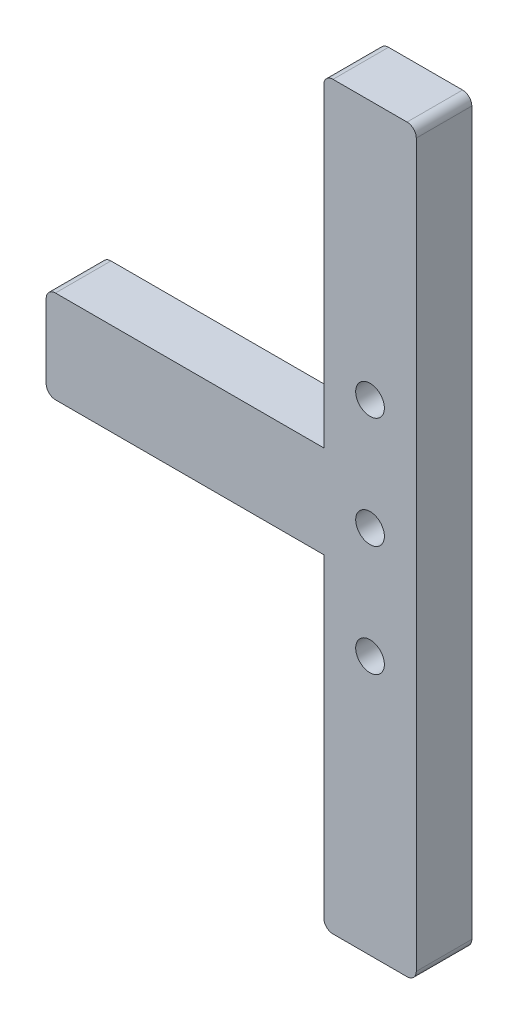
ISO-10303-21;
HEADER;
FILE_DESCRIPTION(('STEP AP214'),'2;1');
FILE_NAME('part.step','',(''),(''),'','','');
FILE_SCHEMA(('AUTOMOTIVE_DESIGN { 1 0 10303 214 1 1 1 1 }'));
ENDSEC;
DATA;
#1=APPLICATION_CONTEXT('core data for automotive mechanical design processes');
#2=APPLICATION_PROTOCOL_DEFINITION('international standard','automotive_design',2000,#1);
#3=PRODUCT_CONTEXT('',#1,'mechanical');
#4=PRODUCT('Part','Part','',(#3));
#5=PRODUCT_RELATED_PRODUCT_CATEGORY('part','',(#4));
#6=PRODUCT_DEFINITION_FORMATION('','',#4);
#7=PRODUCT_DEFINITION_CONTEXT('part definition',#1,'design');
#8=PRODUCT_DEFINITION('design','',#6,#7);
#9=PRODUCT_DEFINITION_SHAPE('','',#8);
#10=(LENGTH_UNIT() NAMED_UNIT(*) SI_UNIT(.MILLI.,.METRE.));
#11=(NAMED_UNIT(*) PLANE_ANGLE_UNIT() SI_UNIT($,.RADIAN.));
#12=(NAMED_UNIT(*) SI_UNIT($,.STERADIAN.) SOLID_ANGLE_UNIT());
#13=UNCERTAINTY_MEASURE_WITH_UNIT(LENGTH_MEASURE(1.E-05),#10,'distance_accuracy_value','');
#14=(GEOMETRIC_REPRESENTATION_CONTEXT(3) GLOBAL_UNCERTAINTY_ASSIGNED_CONTEXT((#13)) GLOBAL_UNIT_ASSIGNED_CONTEXT((#10,
#11,#12)) REPRESENTATION_CONTEXT('',''));
#15=CARTESIAN_POINT('',(0.,0.,0.));
#16=DIRECTION('',(0.,0.,1.));
#17=DIRECTION('',(1.,0.,0.));
#18=AXIS2_PLACEMENT_3D('',#15,#16,#17);
#19=CARTESIAN_POINT('',(0.,4.99999999999999,6.));
#20=DIRECTION('',(0.,-1.,0.));
#21=DIRECTION('',(1.,0.,0.));
#22=AXIS2_PLACEMENT_3D('',#19,#20,#21);
#23=PLANE('',#22);
#24=DIRECTION('',(-1.,0.,0.));
#25=VECTOR('',#24,1.);
#26=CARTESIAN_POINT('',(0.,4.99999999999999,0.));
#27=LINE('',#26,#25);
#28=CARTESIAN_POINT('',(-4.99999999999999,4.99999999999999,0.));
#29=VERTEX_POINT('',#28);
#30=CARTESIAN_POINT('',(-34.,4.99999999999999,0.));
#31=VERTEX_POINT('',#30);
#32=EDGE_CURVE('E192',#29,#31,#27,.T.);
#33=ORIENTED_EDGE('',*,*,#32,.T.);
#34=DIRECTION('',(0.,0.,-1.));
#35=VECTOR('',#34,1.);
#36=CARTESIAN_POINT('',(-34.,4.99999999999999,6.));
#37=LINE('',#36,#35);
#38=CARTESIAN_POINT('',(-34.,4.99999999999999,6.));
#39=VERTEX_POINT('',#38);
#40=EDGE_CURVE('E249',#31,#39,#37,.F.);
#41=ORIENTED_EDGE('',*,*,#40,.T.);
#42=DIRECTION('',(-1.,0.,0.));
#43=VECTOR('',#42,1.);
#44=CARTESIAN_POINT('',(0.,4.99999999999999,6.));
#45=LINE('',#44,#43);
#46=CARTESIAN_POINT('',(-4.99999999999999,4.99999999999999,6.));
#47=VERTEX_POINT('',#46);
#48=EDGE_CURVE('E172',#47,#39,#45,.T.);
#49=ORIENTED_EDGE('',*,*,#48,.F.);
#50=DIRECTION('',(0.,0.,-1.));
#51=VECTOR('',#50,1.);
#52=CARTESIAN_POINT('',(-4.99999999999999,4.99999999999999,6.));
#53=LINE('',#52,#51);
#54=EDGE_CURVE('E155',#47,#29,#53,.T.);
#55=ORIENTED_EDGE('',*,*,#54,.T.);
#56=EDGE_LOOP('',(#33,#41,#49,#55));
#57=FACE_BOUND('',#56,.T.);
#58=ADVANCED_FACE('F41',(#57),#23,.F.);
#59=CARTESIAN_POINT('',(-35.,0.,6.));
#60=DIRECTION('',(1.,0.,0.));
#61=DIRECTION('',(0.,0.,-1.));
#62=AXIS2_PLACEMENT_3D('',#59,#60,#61);
#63=PLANE('',#62);
#64=DIRECTION('',(0.,-1.,0.));
#65=VECTOR('',#64,1.);
#66=CARTESIAN_POINT('',(-35.,0.,0.));
#67=LINE('',#66,#65);
#68=CARTESIAN_POINT('',(-35.,3.99999999999999,0.));
#69=VERTEX_POINT('',#68);
#70=CARTESIAN_POINT('',(-35.,-4.00000000000001,0.));
#71=VERTEX_POINT('',#70);
#72=EDGE_CURVE('E195',#69,#71,#67,.T.);
#73=ORIENTED_EDGE('',*,*,#72,.T.);
#74=DIRECTION('',(0.,0.,-1.));
#75=VECTOR('',#74,1.);
#76=CARTESIAN_POINT('',(-35.,-4.00000000000001,6.));
#77=LINE('',#76,#75);
#78=CARTESIAN_POINT('',(-35.,-4.00000000000001,6.));
#79=VERTEX_POINT('',#78);
#80=EDGE_CURVE('E238',#71,#79,#77,.F.);
#81=ORIENTED_EDGE('',*,*,#80,.T.);
#82=DIRECTION('',(0.,-1.,0.));
#83=VECTOR('',#82,1.);
#84=CARTESIAN_POINT('',(-35.,0.,6.));
#85=LINE('',#84,#83);
#86=CARTESIAN_POINT('',(-35.,3.99999999999999,6.));
#87=VERTEX_POINT('',#86);
#88=EDGE_CURVE('E170',#87,#79,#85,.T.);
#89=ORIENTED_EDGE('',*,*,#88,.F.);
#90=DIRECTION('',(0.,0.,-1.));
#91=VECTOR('',#90,1.);
#92=CARTESIAN_POINT('',(-35.,3.99999999999999,6.));
#93=LINE('',#92,#91);
#94=EDGE_CURVE('E235',#87,#69,#93,.T.);
#95=ORIENTED_EDGE('',*,*,#94,.T.);
#96=EDGE_LOOP('',(#73,#81,#89,#95));
#97=FACE_BOUND('',#96,.T.);
#98=ADVANCED_FACE('F309',(#97),#63,.F.);
#99=CARTESIAN_POINT('',(0.,-5.00000000000001,6.));
#100=DIRECTION('',(0.,-1.,0.));
#101=DIRECTION('',(1.,0.,0.));
#102=AXIS2_PLACEMENT_3D('',#99,#100,#101);
#103=PLANE('',#102);
#104=DIRECTION('',(-1.,0.,0.));
#105=VECTOR('',#104,1.);
#106=CARTESIAN_POINT('',(0.,-5.00000000000001,6.));
#107=LINE('',#106,#105);
#108=CARTESIAN_POINT('',(-4.99999999999999,-5.00000000000001,6.));
#109=VERTEX_POINT('',#108);
#110=CARTESIAN_POINT('',(-34.,-5.00000000000001,6.));
#111=VERTEX_POINT('',#110);
#112=EDGE_CURVE('E147',#109,#111,#107,.T.);
#113=ORIENTED_EDGE('',*,*,#112,.T.);
#114=DIRECTION('',(0.,0.,-1.));
#115=VECTOR('',#114,1.);
#116=CARTESIAN_POINT('',(-34.,-5.00000000000001,0.));
#117=LINE('',#116,#115);
#118=CARTESIAN_POINT('',(-34.,-5.00000000000001,0.));
#119=VERTEX_POINT('',#118);
#120=EDGE_CURVE('E154',#111,#119,#117,.T.);
#121=ORIENTED_EDGE('',*,*,#120,.T.);
#122=DIRECTION('',(-1.,0.,0.));
#123=VECTOR('',#122,1.);
#124=CARTESIAN_POINT('',(0.,-5.00000000000001,0.));
#125=LINE('',#124,#123);
#126=CARTESIAN_POINT('',(-4.99999999999999,-5.00000000000001,0.));
#127=VERTEX_POINT('',#126);
#128=EDGE_CURVE('E150',#127,#119,#125,.T.);
#129=ORIENTED_EDGE('',*,*,#128,.F.);
#130=DIRECTION('',(0.,0.,-1.));
#131=VECTOR('',#130,1.);
#132=CARTESIAN_POINT('',(-4.99999999999999,-5.00000000000001,6.));
#133=LINE('',#132,#131);
#134=EDGE_CURVE('E142',#109,#127,#133,.T.);
#135=ORIENTED_EDGE('',*,*,#134,.F.);
#136=EDGE_LOOP('',(#113,#121,#129,#135));
#137=FACE_BOUND('',#136,.T.);
#138=ADVANCED_FACE('F144',(#137),#103,.T.);
#139=CARTESIAN_POINT('',(-4.99999999999999,0.,6.));
#140=DIRECTION('',(1.,0.,0.));
#141=DIRECTION('',(0.,1.,0.));
#142=AXIS2_PLACEMENT_3D('',#139,#140,#141);
#143=PLANE('',#142);
#144=DIRECTION('',(0.,-1.,0.));
#145=VECTOR('',#144,1.);
#146=CARTESIAN_POINT('',(-4.99999999999999,0.,0.));
#147=LINE('',#146,#145);
#148=CARTESIAN_POINT('',(-4.99999999999998,-38.9999999999998,0.));
#149=VERTEX_POINT('',#148);
#150=EDGE_CURVE('E199',#127,#149,#147,.T.);
#151=ORIENTED_EDGE('',*,*,#150,.T.);
#152=DIRECTION('',(0.,0.,-1.));
#153=VECTOR('',#152,1.);
#154=CARTESIAN_POINT('',(-4.99999999999998,-38.9999999999998,6.));
#155=LINE('',#154,#153);
#156=CARTESIAN_POINT('',(-4.99999999999998,-38.9999999999998,6.));
#157=VERTEX_POINT('',#156);
#158=EDGE_CURVE('E11',#149,#157,#155,.F.);
#159=ORIENTED_EDGE('',*,*,#158,.T.);
#160=DIRECTION('',(0.,-1.,0.));
#161=VECTOR('',#160,1.);
#162=CARTESIAN_POINT('',(-4.99999999999999,0.,6.));
#163=LINE('',#162,#161);
#164=EDGE_CURVE('E158',#109,#157,#163,.T.);
#165=ORIENTED_EDGE('',*,*,#164,.F.);
#166=ORIENTED_EDGE('',*,*,#134,.T.);
#167=EDGE_LOOP('',(#151,#159,#165,#166));
#168=FACE_BOUND('',#167,.T.);
#169=ADVANCED_FACE('F159',(#168),#143,.F.);
#170=CARTESIAN_POINT('',(0.,-39.9999999999998,6.));
#171=DIRECTION('',(0.,1.,0.));
#172=DIRECTION('',(0.,0.,1.));
#173=AXIS2_PLACEMENT_3D('',#170,#171,#172);
#174=PLANE('',#173);
#175=DIRECTION('',(1.,0.,0.));
#176=VECTOR('',#175,1.);
#177=CARTESIAN_POINT('',(0.,-39.9999999999998,6.));
#178=LINE('',#177,#176);
#179=CARTESIAN_POINT('',(-3.99999999999998,-39.9999999999998,6.));
#180=VERTEX_POINT('',#179);
#181=CARTESIAN_POINT('',(4.,-39.9999999999998,6.));
#182=VERTEX_POINT('',#181);
#183=EDGE_CURVE('E162',#180,#182,#178,.T.);
#184=ORIENTED_EDGE('',*,*,#183,.F.);
#185=DIRECTION('',(0.,0.,-1.));
#186=VECTOR('',#185,1.);
#187=CARTESIAN_POINT('',(-3.99999999999998,-39.9999999999998,6.));
#188=LINE('',#187,#186);
#189=CARTESIAN_POINT('',(-3.99999999999998,-39.9999999999998,0.));
#190=VERTEX_POINT('',#189);
#191=EDGE_CURVE('E49',#180,#190,#188,.T.);
#192=ORIENTED_EDGE('',*,*,#191,.T.);
#193=DIRECTION('',(1.,0.,0.));
#194=VECTOR('',#193,1.);
#195=CARTESIAN_POINT('',(0.,-39.9999999999998,0.));
#196=LINE('',#195,#194);
#197=CARTESIAN_POINT('',(4.,-39.9999999999998,0.));
#198=VERTEX_POINT('',#197);
#199=EDGE_CURVE('E201',#190,#198,#196,.T.);
#200=ORIENTED_EDGE('',*,*,#199,.T.);
#201=DIRECTION('',(0.,0.,-1.));
#202=VECTOR('',#201,1.);
#203=CARTESIAN_POINT('',(4.,-39.9999999999998,6.));
#204=LINE('',#203,#202);
#205=EDGE_CURVE('E264',#198,#182,#204,.F.);
#206=ORIENTED_EDGE('',*,*,#205,.T.);
#207=EDGE_LOOP('',(#184,#192,#200,#206));
#208=FACE_BOUND('',#207,.T.);
#209=ADVANCED_FACE('F270',(#208),#174,.F.);
#210=CARTESIAN_POINT('',(5.,0.,6.));
#211=DIRECTION('',(1.,0.,0.));
#212=DIRECTION('',(0.,0.,-1.));
#213=AXIS2_PLACEMENT_3D('',#210,#211,#212);
#214=PLANE('',#213);
#215=DIRECTION('',(0.,-1.,0.));
#216=VECTOR('',#215,1.);
#217=CARTESIAN_POINT('',(5.,0.,0.));
#218=LINE('',#217,#216);
#219=CARTESIAN_POINT('',(5.,39.0000000000002,0.));
#220=VERTEX_POINT('',#219);
#221=CARTESIAN_POINT('',(5.,-38.9999999999998,0.));
#222=VERTEX_POINT('',#221);
#223=EDGE_CURVE('E205',#220,#222,#218,.T.);
#224=ORIENTED_EDGE('',*,*,#223,.F.);
#225=DIRECTION('',(0.,0.,-1.));
#226=VECTOR('',#225,1.);
#227=CARTESIAN_POINT('',(5.,39.0000000000002,6.));
#228=LINE('',#227,#226);
#229=CARTESIAN_POINT('',(5.,39.0000000000002,6.));
#230=VERTEX_POINT('',#229);
#231=EDGE_CURVE('E262',#220,#230,#228,.F.);
#232=ORIENTED_EDGE('',*,*,#231,.T.);
#233=DIRECTION('',(0.,-1.,0.));
#234=VECTOR('',#233,1.);
#235=CARTESIAN_POINT('',(5.,0.,6.));
#236=LINE('',#235,#234);
#237=CARTESIAN_POINT('',(5.,-38.9999999999998,6.));
#238=VERTEX_POINT('',#237);
#239=EDGE_CURVE('E178',#230,#238,#236,.T.);
#240=ORIENTED_EDGE('',*,*,#239,.T.);
#241=DIRECTION('',(0.,0.,-1.));
#242=VECTOR('',#241,1.);
#243=CARTESIAN_POINT('',(5.,-38.9999999999998,0.));
#244=LINE('',#243,#242);
#245=EDGE_CURVE('E259',#238,#222,#244,.T.);
#246=ORIENTED_EDGE('',*,*,#245,.T.);
#247=EDGE_LOOP('',(#224,#232,#240,#246));
#248=FACE_BOUND('',#247,.T.);
#249=ADVANCED_FACE('F281',(#248),#214,.T.);
#250=CARTESIAN_POINT('',(0.,40.0000000000002,6.));
#251=DIRECTION('',(0.,1.,0.));
#252=DIRECTION('',(0.,0.,1.));
#253=AXIS2_PLACEMENT_3D('',#250,#251,#252);
#254=PLANE('',#253);
#255=DIRECTION('',(1.,0.,0.));
#256=VECTOR('',#255,1.);
#257=CARTESIAN_POINT('',(0.,40.0000000000002,0.));
#258=LINE('',#257,#256);
#259=CARTESIAN_POINT('',(-4.,40.0000000000002,0.));
#260=VERTEX_POINT('',#259);
#261=CARTESIAN_POINT('',(4.,40.0000000000002,0.));
#262=VERTEX_POINT('',#261);
#263=EDGE_CURVE('E208',#260,#262,#258,.T.);
#264=ORIENTED_EDGE('',*,*,#263,.F.);
#265=DIRECTION('',(0.,0.,-1.));
#266=VECTOR('',#265,1.);
#267=CARTESIAN_POINT('',(-4.,40.0000000000002,6.));
#268=LINE('',#267,#266);
#269=CARTESIAN_POINT('',(-4.,40.0000000000002,6.));
#270=VERTEX_POINT('',#269);
#271=EDGE_CURVE('E257',#260,#270,#268,.F.);
#272=ORIENTED_EDGE('',*,*,#271,.T.);
#273=DIRECTION('',(1.,0.,0.));
#274=VECTOR('',#273,1.);
#275=CARTESIAN_POINT('',(0.,40.0000000000002,6.));
#276=LINE('',#275,#274);
#277=CARTESIAN_POINT('',(4.,40.0000000000002,6.));
#278=VERTEX_POINT('',#277);
#279=EDGE_CURVE('E181',#270,#278,#276,.T.);
#280=ORIENTED_EDGE('',*,*,#279,.T.);
#281=DIRECTION('',(0.,0.,-1.));
#282=VECTOR('',#281,1.);
#283=CARTESIAN_POINT('',(4.,40.0000000000002,6.));
#284=LINE('',#283,#282);
#285=EDGE_CURVE('E254',#278,#262,#284,.T.);
#286=ORIENTED_EDGE('',*,*,#285,.T.);
#287=EDGE_LOOP('',(#264,#272,#280,#286));
#288=FACE_BOUND('',#287,.T.);
#289=ADVANCED_FACE('F288',(#288),#254,.T.);
#290=CARTESIAN_POINT('',(0.,0.,6.));
#291=DIRECTION('',(0.,0.,-1.));
#292=DIRECTION('',(-1.,0.,0.));
#293=AXIS2_PLACEMENT_3D('',#290,#291,#292);
#294=CYLINDRICAL_SURFACE('',#293,1.54999999999999);
#295=CARTESIAN_POINT('',(0.,0.,6.));
#296=DIRECTION('',(0.,0.,1.));
#297=DIRECTION('',(1.,0.,0.));
#298=AXIS2_PLACEMENT_3D('',#295,#296,#297);
#299=CIRCLE('',#298,1.54999999999999);
#300=CARTESIAN_POINT('',(1.54999999999999,0.,6.));
#301=VERTEX_POINT('',#300);
#302=EDGE_CURVE('E186',#301,#301,#299,.T.);
#303=ORIENTED_EDGE('',*,*,#302,.T.);
#304=EDGE_LOOP('',(#303));
#305=FACE_BOUND('',#304,.T.);
#306=CARTESIAN_POINT('',(0.,0.,0.));
#307=DIRECTION('',(0.,0.,1.));
#308=DIRECTION('',(1.,0.,0.));
#309=AXIS2_PLACEMENT_3D('',#306,#307,#308);
#310=CIRCLE('',#309,1.54999999999999);
#311=CARTESIAN_POINT('',(1.54999999999999,0.,0.));
#312=VERTEX_POINT('',#311);
#313=EDGE_CURVE('E214',#312,#312,#310,.T.);
#314=ORIENTED_EDGE('',*,*,#313,.F.);
#315=EDGE_LOOP('',(#314));
#316=FACE_BOUND('',#315,.T.);
#317=ADVANCED_FACE('F338',(#305,#316),#294,.F.);
#318=CARTESIAN_POINT('',(0.,-12.,6.));
#319=DIRECTION('',(0.,0.,-1.));
#320=DIRECTION('',(-1.,0.,0.));
#321=AXIS2_PLACEMENT_3D('',#318,#319,#320);
#322=CYLINDRICAL_SURFACE('',#321,1.54999999999999);
#323=CARTESIAN_POINT('',(0.,-12.,6.));
#324=DIRECTION('',(0.,0.,1.));
#325=DIRECTION('',(1.,0.,0.));
#326=AXIS2_PLACEMENT_3D('',#323,#324,#325);
#327=CIRCLE('',#326,1.54999999999999);
#328=CARTESIAN_POINT('',(1.55,-12.,6.));
#329=VERTEX_POINT('',#328);
#330=EDGE_CURVE('E183',#329,#329,#327,.T.);
#331=ORIENTED_EDGE('',*,*,#330,.T.);
#332=EDGE_LOOP('',(#331));
#333=FACE_BOUND('',#332,.T.);
#334=CARTESIAN_POINT('',(0.,-12.,0.));
#335=DIRECTION('',(0.,0.,1.));
#336=DIRECTION('',(1.,0.,0.));
#337=AXIS2_PLACEMENT_3D('',#334,#335,#336);
#338=CIRCLE('',#337,1.54999999999999);
#339=CARTESIAN_POINT('',(1.55,-12.,0.));
#340=VERTEX_POINT('',#339);
#341=EDGE_CURVE('E211',#340,#340,#338,.T.);
#342=ORIENTED_EDGE('',*,*,#341,.F.);
#343=EDGE_LOOP('',(#342));
#344=FACE_BOUND('',#343,.T.);
#345=ADVANCED_FACE('F342',(#333,#344),#322,.F.);
#346=CARTESIAN_POINT('',(-5.,39.0000000000002,6.));
#347=VERTEX_POINT('',#346);
#348=EDGE_CURVE('E164',#347,#47,#163,.T.);
#349=ORIENTED_EDGE('',*,*,#348,.F.);
#350=DIRECTION('',(0.,0.,-1.));
#351=VECTOR('',#350,1.);
#352=CARTESIAN_POINT('',(-5.,39.0000000000002,0.));
#353=LINE('',#352,#351);
#354=CARTESIAN_POINT('',(-5.,39.0000000000002,0.));
#355=VERTEX_POINT('',#354);
#356=EDGE_CURVE('E251',#347,#355,#353,.T.);
#357=ORIENTED_EDGE('',*,*,#356,.T.);
#358=EDGE_CURVE('E202',#355,#29,#147,.T.);
#359=ORIENTED_EDGE('',*,*,#358,.T.);
#360=ORIENTED_EDGE('',*,*,#54,.F.);
#361=EDGE_LOOP('',(#349,#357,#359,#360));
#362=FACE_BOUND('',#361,.T.);
#363=ADVANCED_FACE('F296',(#362),#143,.F.);
#364=CARTESIAN_POINT('',(0.,12.,6.));
#365=DIRECTION('',(0.,0.,-1.));
#366=DIRECTION('',(-1.,0.,0.));
#367=AXIS2_PLACEMENT_3D('',#364,#365,#366);
#368=CYLINDRICAL_SURFACE('',#367,1.54999999999999);
#369=CARTESIAN_POINT('',(0.,12.,6.));
#370=DIRECTION('',(0.,0.,1.));
#371=DIRECTION('',(1.,0.,0.));
#372=AXIS2_PLACEMENT_3D('',#369,#370,#371);
#373=CIRCLE('',#372,1.54999999999999);
#374=CARTESIAN_POINT('',(1.55,12.,6.));
#375=VERTEX_POINT('',#374);
#376=EDGE_CURVE('E189',#375,#375,#373,.T.);
#377=ORIENTED_EDGE('',*,*,#376,.T.);
#378=EDGE_LOOP('',(#377));
#379=FACE_BOUND('',#378,.T.);
#380=CARTESIAN_POINT('',(0.,12.,0.));
#381=DIRECTION('',(0.,0.,1.));
#382=DIRECTION('',(1.,0.,0.));
#383=AXIS2_PLACEMENT_3D('',#380,#381,#382);
#384=CIRCLE('',#383,1.54999999999999);
#385=CARTESIAN_POINT('',(1.55,12.,0.));
#386=VERTEX_POINT('',#385);
#387=EDGE_CURVE('E217',#386,#386,#384,.T.);
#388=ORIENTED_EDGE('',*,*,#387,.F.);
#389=EDGE_LOOP('',(#388));
#390=FACE_BOUND('',#389,.T.);
#391=ADVANCED_FACE('F341',(#379,#390),#368,.F.);
#392=CARTESIAN_POINT('',(0.,0.,6.));
#393=DIRECTION('',(0.,0.,1.));
#394=DIRECTION('',(1.,0.,0.));
#395=AXIS2_PLACEMENT_3D('',#392,#393,#394);
#396=PLANE('',#395);
#397=ORIENTED_EDGE('',*,*,#88,.T.);
#398=CARTESIAN_POINT('',(-34.,-4.00000000000001,6.));
#399=DIRECTION('',(0.,0.,1.));
#400=DIRECTION('',(1.,0.,0.));
#401=AXIS2_PLACEMENT_3D('',#398,#399,#400);
#402=CIRCLE('',#401,1.);
#403=EDGE_CURVE('E169',#79,#111,#402,.T.);
#404=ORIENTED_EDGE('',*,*,#403,.T.);
#405=ORIENTED_EDGE('',*,*,#112,.F.);
#406=ORIENTED_EDGE('',*,*,#164,.T.);
#407=CARTESIAN_POINT('',(-3.99999999999998,-38.9999999999998,6.));
#408=DIRECTION('',(0.,0.,1.));
#409=DIRECTION('',(1.,0.,0.));
#410=AXIS2_PLACEMENT_3D('',#407,#408,#409);
#411=CIRCLE('',#410,1.);
#412=EDGE_CURVE('E242',#157,#180,#411,.T.);
#413=ORIENTED_EDGE('',*,*,#412,.T.);
#414=ORIENTED_EDGE('',*,*,#183,.T.);
#415=CARTESIAN_POINT('',(4.,-38.9999999999998,6.));
#416=DIRECTION('',(0.,0.,1.));
#417=DIRECTION('',(1.,0.,0.));
#418=AXIS2_PLACEMENT_3D('',#415,#416,#417);
#419=CIRCLE('',#418,1.);
#420=EDGE_CURVE('E240',#182,#238,#419,.T.);
#421=ORIENTED_EDGE('',*,*,#420,.T.);
#422=ORIENTED_EDGE('',*,*,#239,.F.);
#423=CARTESIAN_POINT('',(4.,39.0000000000002,6.));
#424=DIRECTION('',(0.,0.,1.));
#425=DIRECTION('',(1.,0.,0.));
#426=AXIS2_PLACEMENT_3D('',#423,#424,#425);
#427=CIRCLE('',#426,1.);
#428=EDGE_CURVE('E62',#230,#278,#427,.T.);
#429=ORIENTED_EDGE('',*,*,#428,.T.);
#430=ORIENTED_EDGE('',*,*,#279,.F.);
#431=CARTESIAN_POINT('',(-4.,39.0000000000002,6.));
#432=DIRECTION('',(0.,0.,1.));
#433=DIRECTION('',(1.,0.,0.));
#434=AXIS2_PLACEMENT_3D('',#431,#432,#433);
#435=CIRCLE('',#434,1.);
#436=EDGE_CURVE('E56',#270,#347,#435,.T.);
#437=ORIENTED_EDGE('',*,*,#436,.T.);
#438=ORIENTED_EDGE('',*,*,#348,.T.);
#439=ORIENTED_EDGE('',*,*,#48,.T.);
#440=CARTESIAN_POINT('',(-34.,3.99999999999999,6.));
#441=DIRECTION('',(0.,0.,1.));
#442=DIRECTION('',(1.,0.,0.));
#443=AXIS2_PLACEMENT_3D('',#440,#441,#442);
#444=CIRCLE('',#443,1.);
#445=EDGE_CURVE('E246',#39,#87,#444,.T.);
#446=ORIENTED_EDGE('',*,*,#445,.T.);
#447=EDGE_LOOP('',(#397,#404,#405,#406,#413,#414,#421,#422,#429,#430,#437,#438,#439,#446));
#448=FACE_BOUND('',#447,.T.);
#449=ORIENTED_EDGE('',*,*,#330,.F.);
#450=EDGE_LOOP('',(#449));
#451=FACE_BOUND('',#450,.T.);
#452=ORIENTED_EDGE('',*,*,#302,.F.);
#453=EDGE_LOOP('',(#452));
#454=FACE_BOUND('',#453,.T.);
#455=ORIENTED_EDGE('',*,*,#376,.F.);
#456=EDGE_LOOP('',(#455));
#457=FACE_BOUND('',#456,.T.);
#458=ADVANCED_FACE('F166',(#448,#451,#454,#457),#396,.T.);
#459=CARTESIAN_POINT('',(0.,0.,0.));
#460=DIRECTION('',(0.,0.,1.));
#461=DIRECTION('',(1.,0.,0.));
#462=AXIS2_PLACEMENT_3D('',#459,#460,#461);
#463=PLANE('',#462);
#464=ORIENTED_EDGE('',*,*,#128,.T.);
#465=CARTESIAN_POINT('',(-34.,-4.00000000000001,0.));
#466=DIRECTION('',(0.,0.,1.));
#467=DIRECTION('',(1.,0.,0.));
#468=AXIS2_PLACEMENT_3D('',#465,#466,#467);
#469=CIRCLE('',#468,1.);
#470=EDGE_CURVE('E233',#119,#71,#469,.F.);
#471=ORIENTED_EDGE('',*,*,#470,.T.);
#472=ORIENTED_EDGE('',*,*,#72,.F.);
#473=CARTESIAN_POINT('',(-34.,3.99999999999999,0.));
#474=DIRECTION('',(0.,0.,1.));
#475=DIRECTION('',(1.,0.,0.));
#476=AXIS2_PLACEMENT_3D('',#473,#474,#475);
#477=CIRCLE('',#476,1.);
#478=EDGE_CURVE('E231',#69,#31,#477,.F.);
#479=ORIENTED_EDGE('',*,*,#478,.T.);
#480=ORIENTED_EDGE('',*,*,#32,.F.);
#481=ORIENTED_EDGE('',*,*,#358,.F.);
#482=CARTESIAN_POINT('',(-4.,39.0000000000002,0.));
#483=DIRECTION('',(0.,0.,1.));
#484=DIRECTION('',(1.,0.,0.));
#485=AXIS2_PLACEMENT_3D('',#482,#483,#484);
#486=CIRCLE('',#485,1.);
#487=EDGE_CURVE('E229',#355,#260,#486,.F.);
#488=ORIENTED_EDGE('',*,*,#487,.T.);
#489=ORIENTED_EDGE('',*,*,#263,.T.);
#490=CARTESIAN_POINT('',(4.,39.0000000000002,0.));
#491=DIRECTION('',(0.,0.,1.));
#492=DIRECTION('',(1.,0.,0.));
#493=AXIS2_PLACEMENT_3D('',#490,#491,#492);
#494=CIRCLE('',#493,1.);
#495=EDGE_CURVE('E227',#262,#220,#494,.F.);
#496=ORIENTED_EDGE('',*,*,#495,.T.);
#497=ORIENTED_EDGE('',*,*,#223,.T.);
#498=CARTESIAN_POINT('',(4.,-38.9999999999998,0.));
#499=DIRECTION('',(0.,0.,1.));
#500=DIRECTION('',(1.,0.,0.));
#501=AXIS2_PLACEMENT_3D('',#498,#499,#500);
#502=CIRCLE('',#501,1.);
#503=EDGE_CURVE('E223',#222,#198,#502,.F.);
#504=ORIENTED_EDGE('',*,*,#503,.T.);
#505=ORIENTED_EDGE('',*,*,#199,.F.);
#506=CARTESIAN_POINT('',(-3.99999999999998,-38.9999999999998,0.));
#507=DIRECTION('',(0.,0.,1.));
#508=DIRECTION('',(1.,0.,0.));
#509=AXIS2_PLACEMENT_3D('',#506,#507,#508);
#510=CIRCLE('',#509,1.);
#511=EDGE_CURVE('E225',#190,#149,#510,.F.);
#512=ORIENTED_EDGE('',*,*,#511,.T.);
#513=ORIENTED_EDGE('',*,*,#150,.F.);
#514=EDGE_LOOP('',(#464,#471,#472,#479,#480,#481,#488,#489,#496,#497,#504,#505,#512,#513));
#515=FACE_BOUND('',#514,.T.);
#516=ORIENTED_EDGE('',*,*,#341,.T.);
#517=EDGE_LOOP('',(#516));
#518=FACE_BOUND('',#517,.T.);
#519=ORIENTED_EDGE('',*,*,#313,.T.);
#520=EDGE_LOOP('',(#519));
#521=FACE_BOUND('',#520,.T.);
#522=ORIENTED_EDGE('',*,*,#387,.T.);
#523=EDGE_LOOP('',(#522));
#524=FACE_BOUND('',#523,.T.);
#525=ADVANCED_FACE('F274',(#515,#518,#521,#524),#463,.F.);
#526=CARTESIAN_POINT('',(-34.,-4.00000000000001,6.));
#527=DIRECTION('',(0.,0.,1.));
#528=DIRECTION('',(1.,0.,0.));
#529=AXIS2_PLACEMENT_3D('',#526,#527,#528);
#530=CYLINDRICAL_SURFACE('',#529,1.);
#531=ORIENTED_EDGE('',*,*,#403,.F.);
#532=ORIENTED_EDGE('',*,*,#80,.F.);
#533=ORIENTED_EDGE('',*,*,#470,.F.);
#534=ORIENTED_EDGE('',*,*,#120,.F.);
#535=EDGE_LOOP('',(#531,#532,#533,#534));
#536=FACE_BOUND('',#535,.T.);
#537=ADVANCED_FACE('F312',(#536),#530,.T.);
#538=CARTESIAN_POINT('',(-34.,3.99999999999999,6.));
#539=DIRECTION('',(0.,0.,-1.));
#540=DIRECTION('',(-1.,0.,0.));
#541=AXIS2_PLACEMENT_3D('',#538,#539,#540);
#542=CYLINDRICAL_SURFACE('',#541,1.);
#543=ORIENTED_EDGE('',*,*,#445,.F.);
#544=ORIENTED_EDGE('',*,*,#40,.F.);
#545=ORIENTED_EDGE('',*,*,#478,.F.);
#546=ORIENTED_EDGE('',*,*,#94,.F.);
#547=EDGE_LOOP('',(#543,#544,#545,#546));
#548=FACE_BOUND('',#547,.T.);
#549=ADVANCED_FACE('F306',(#548),#542,.T.);
#550=CARTESIAN_POINT('',(-4.,39.0000000000002,6.));
#551=DIRECTION('',(0.,0.,1.));
#552=DIRECTION('',(1.,0.,0.));
#553=AXIS2_PLACEMENT_3D('',#550,#551,#552);
#554=CYLINDRICAL_SURFACE('',#553,1.);
#555=ORIENTED_EDGE('',*,*,#436,.F.);
#556=ORIENTED_EDGE('',*,*,#271,.F.);
#557=ORIENTED_EDGE('',*,*,#487,.F.);
#558=ORIENTED_EDGE('',*,*,#356,.F.);
#559=EDGE_LOOP('',(#555,#556,#557,#558));
#560=FACE_BOUND('',#559,.T.);
#561=ADVANCED_FACE('F294',(#560),#554,.T.);
#562=CARTESIAN_POINT('',(4.,39.0000000000002,6.));
#563=DIRECTION('',(0.,0.,-1.));
#564=DIRECTION('',(-1.,0.,0.));
#565=AXIS2_PLACEMENT_3D('',#562,#563,#564);
#566=CYLINDRICAL_SURFACE('',#565,1.);
#567=ORIENTED_EDGE('',*,*,#428,.F.);
#568=ORIENTED_EDGE('',*,*,#231,.F.);
#569=ORIENTED_EDGE('',*,*,#495,.F.);
#570=ORIENTED_EDGE('',*,*,#285,.F.);
#571=EDGE_LOOP('',(#567,#568,#569,#570));
#572=FACE_BOUND('',#571,.T.);
#573=ADVANCED_FACE('F285',(#572),#566,.T.);
#574=CARTESIAN_POINT('',(-3.99999999999998,-38.9999999999998,6.));
#575=DIRECTION('',(0.,0.,-1.));
#576=DIRECTION('',(-1.,0.,0.));
#577=AXIS2_PLACEMENT_3D('',#574,#575,#576);
#578=CYLINDRICAL_SURFACE('',#577,1.);
#579=ORIENTED_EDGE('',*,*,#412,.F.);
#580=ORIENTED_EDGE('',*,*,#158,.F.);
#581=ORIENTED_EDGE('',*,*,#511,.F.);
#582=ORIENTED_EDGE('',*,*,#191,.F.);
#583=EDGE_LOOP('',(#579,#580,#581,#582));
#584=FACE_BOUND('',#583,.T.);
#585=ADVANCED_FACE('F388',(#584),#578,.T.);
#586=CARTESIAN_POINT('',(4.,-38.9999999999998,6.));
#587=DIRECTION('',(0.,0.,1.));
#588=DIRECTION('',(1.,0.,0.));
#589=AXIS2_PLACEMENT_3D('',#586,#587,#588);
#590=CYLINDRICAL_SURFACE('',#589,1.);
#591=ORIENTED_EDGE('',*,*,#420,.F.);
#592=ORIENTED_EDGE('',*,*,#205,.F.);
#593=ORIENTED_EDGE('',*,*,#503,.F.);
#594=ORIENTED_EDGE('',*,*,#245,.F.);
#595=EDGE_LOOP('',(#591,#592,#593,#594));
#596=FACE_BOUND('',#595,.T.);
#597=ADVANCED_FACE('F43',(#596),#590,.T.);
#598=CLOSED_SHELL('',(#58,#98,#138,#169,#209,#249,#289,#317,#345,#363,#391,#458,#525,#537,#549,
#561,#573,#585,#597));
#599=MANIFOLD_SOLID_BREP('B2',#598);
#600=ADVANCED_BREP_SHAPE_REPRESENTATION('',(#18,#599),#14);
#601=SHAPE_DEFINITION_REPRESENTATION(#9,#600);
ENDSEC;
END-ISO-10303-21;
